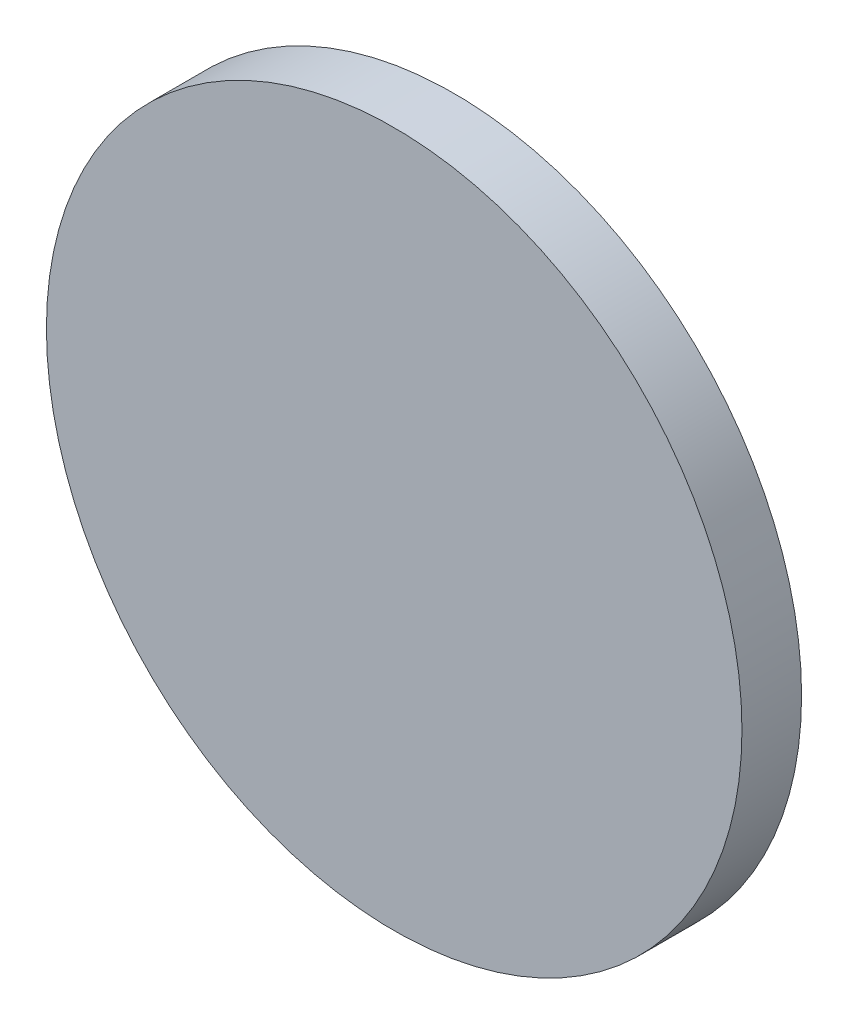
ISO-10303-21;
HEADER;
FILE_DESCRIPTION(('STEP AP214'),'2;1');
FILE_NAME('part.step','',(''),(''),'','','');
FILE_SCHEMA(('AUTOMOTIVE_DESIGN { 1 0 10303 214 1 1 1 1 }'));
ENDSEC;
DATA;
#1=APPLICATION_CONTEXT('core data for automotive mechanical design processes');
#2=APPLICATION_PROTOCOL_DEFINITION('international standard','automotive_design',2000,#1);
#3=PRODUCT_CONTEXT('',#1,'mechanical');
#4=PRODUCT('Part','Part','',(#3));
#5=PRODUCT_RELATED_PRODUCT_CATEGORY('part','',(#4));
#6=PRODUCT_DEFINITION_FORMATION('','',#4);
#7=PRODUCT_DEFINITION_CONTEXT('part definition',#1,'design');
#8=PRODUCT_DEFINITION('design','',#6,#7);
#9=PRODUCT_DEFINITION_SHAPE('','',#8);
#10=(LENGTH_UNIT() NAMED_UNIT(*) SI_UNIT(.MILLI.,.METRE.));
#11=(NAMED_UNIT(*) PLANE_ANGLE_UNIT() SI_UNIT($,.RADIAN.));
#12=(NAMED_UNIT(*) SI_UNIT($,.STERADIAN.) SOLID_ANGLE_UNIT());
#13=UNCERTAINTY_MEASURE_WITH_UNIT(LENGTH_MEASURE(1.E-05),#10,'distance_accuracy_value','');
#14=(GEOMETRIC_REPRESENTATION_CONTEXT(3) GLOBAL_UNCERTAINTY_ASSIGNED_CONTEXT((#13)) GLOBAL_UNIT_ASSIGNED_CONTEXT((#10,
#11,#12)) REPRESENTATION_CONTEXT('',''));
#15=CARTESIAN_POINT('',(0.,0.,0.));
#16=DIRECTION('',(0.,0.,1.));
#17=DIRECTION('',(1.,0.,0.));
#18=AXIS2_PLACEMENT_3D('',#15,#16,#17);
#19=CARTESIAN_POINT('',(11.35342,4.640580014875,0.79916));
#20=DIRECTION('',(0.,0.,1.));
#21=DIRECTION('',(1.,0.,0.));
#22=AXIS2_PLACEMENT_3D('',#19,#20,#21);
#23=PLANE('',#22);
#24=CARTESIAN_POINT('',(11.35342,4.640580014875,0.79916));
#25=DIRECTION('',(0.,0.,1.));
#26=DIRECTION('',(1.,0.,0.));
#27=AXIS2_PLACEMENT_3D('',#24,#25,#26);
#28=CIRCLE('',#27,0.200024667);
#29=CARTESIAN_POINT('',(11.553444667,4.640580014875,0.79916));
#30=VERTEX_POINT('',#29);
#31=EDGE_CURVE('E18',#30,#30,#28,.F.);
#32=ORIENTED_EDGE('',*,*,#31,.F.);
#33=EDGE_LOOP('',(#32));
#34=FACE_BOUND('',#33,.T.);
#35=ADVANCED_FACE('F15',(#34),#23,.T.);
#36=CARTESIAN_POINT('',(11.35342,4.640580014875,0.76487));
#37=DIRECTION('',(0.,0.,1.));
#38=DIRECTION('',(1.,0.,0.));
#39=AXIS2_PLACEMENT_3D('',#36,#37,#38);
#40=CYLINDRICAL_SURFACE('',#39,0.200024667);
#41=ORIENTED_EDGE('',*,*,#31,.T.);
#42=EDGE_LOOP('',(#41));
#43=FACE_BOUND('',#42,.T.);
#44=CARTESIAN_POINT('',(11.35342,4.640580014875,0.76487));
#45=DIRECTION('',(0.,0.,1.));
#46=DIRECTION('',(1.,0.,0.));
#47=AXIS2_PLACEMENT_3D('',#44,#45,#46);
#48=CIRCLE('',#47,0.200024667);
#49=CARTESIAN_POINT('',(11.553444667,4.640580014875,0.76487));
#50=VERTEX_POINT('',#49);
#51=EDGE_CURVE('E10',#50,#50,#48,.F.);
#52=ORIENTED_EDGE('',*,*,#51,.F.);
#53=EDGE_LOOP('',(#52));
#54=FACE_BOUND('',#53,.T.);
#55=ADVANCED_FACE('F27',(#43,#54),#40,.T.);
#56=CARTESIAN_POINT('',(11.35342,4.640580014875,0.76487));
#57=DIRECTION('',(0.,0.,-1.));
#58=DIRECTION('',(-1.,0.,0.));
#59=AXIS2_PLACEMENT_3D('',#56,#57,#58);
#60=PLANE('',#59);
#61=ORIENTED_EDGE('',*,*,#51,.T.);
#62=EDGE_LOOP('',(#61));
#63=FACE_BOUND('',#62,.T.);
#64=ADVANCED_FACE('F35',(#63),#60,.T.);
#65=CLOSED_SHELL('',(#35,#55,#64));
#66=MANIFOLD_SOLID_BREP('B1',#65);
#67=ADVANCED_BREP_SHAPE_REPRESENTATION('',(#18,#66),#14);
#68=SHAPE_DEFINITION_REPRESENTATION(#9,#67);
ENDSEC;
END-ISO-10303-21;
